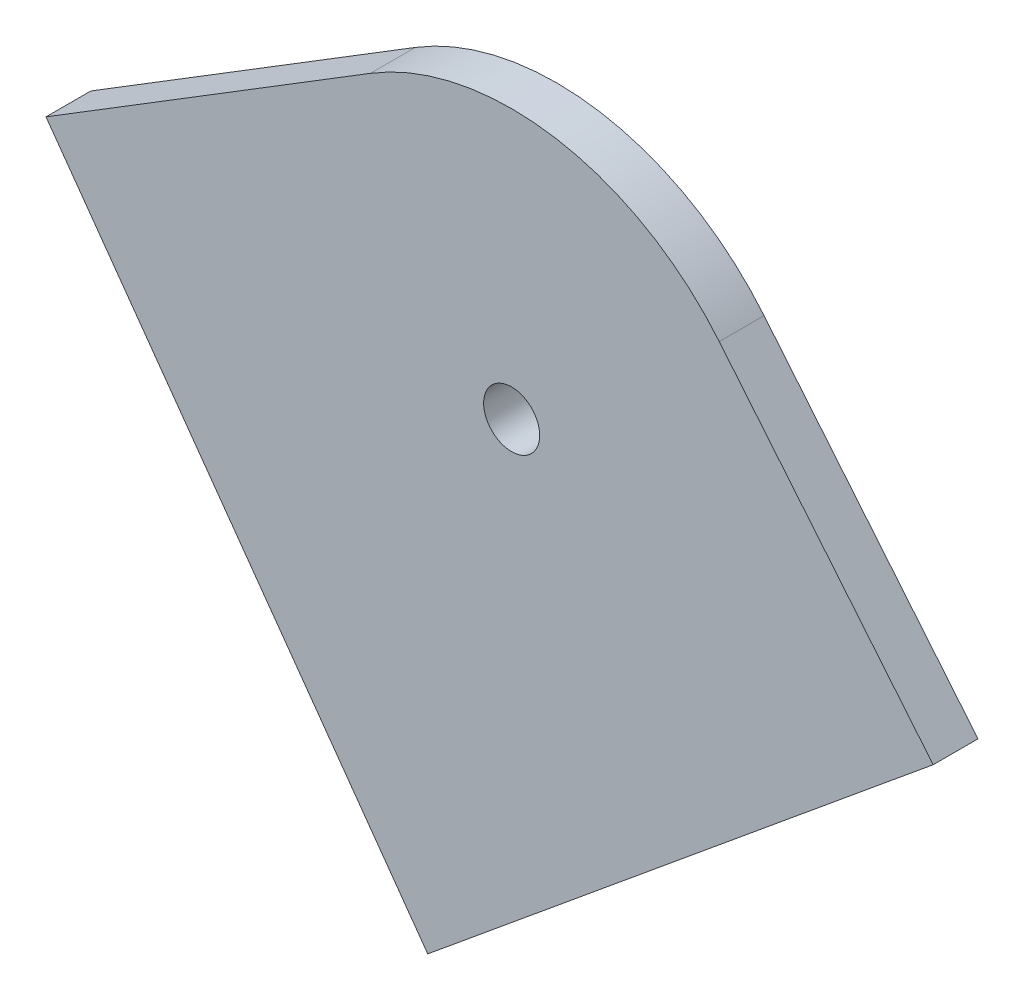
ISO-10303-21;
HEADER;
FILE_DESCRIPTION(('STEP AP214'),'2;1');
FILE_NAME('part.step','',(''),(''),'','','');
FILE_SCHEMA(('AUTOMOTIVE_DESIGN { 1 0 10303 214 1 1 1 1 }'));
ENDSEC;
DATA;
#1=APPLICATION_CONTEXT('core data for automotive mechanical design processes');
#2=APPLICATION_PROTOCOL_DEFINITION('international standard','automotive_design',2000,#1);
#3=PRODUCT_CONTEXT('',#1,'mechanical');
#4=PRODUCT('Part','Part','',(#3));
#5=PRODUCT_RELATED_PRODUCT_CATEGORY('part','',(#4));
#6=PRODUCT_DEFINITION_FORMATION('','',#4);
#7=PRODUCT_DEFINITION_CONTEXT('part definition',#1,'design');
#8=PRODUCT_DEFINITION('design','',#6,#7);
#9=PRODUCT_DEFINITION_SHAPE('','',#8);
#10=(LENGTH_UNIT() NAMED_UNIT(*) SI_UNIT(.MILLI.,.METRE.));
#11=(NAMED_UNIT(*) PLANE_ANGLE_UNIT() SI_UNIT($,.RADIAN.));
#12=(NAMED_UNIT(*) SI_UNIT($,.STERADIAN.) SOLID_ANGLE_UNIT());
#13=UNCERTAINTY_MEASURE_WITH_UNIT(LENGTH_MEASURE(1.E-05),#10,'distance_accuracy_value','');
#14=(GEOMETRIC_REPRESENTATION_CONTEXT(3) GLOBAL_UNCERTAINTY_ASSIGNED_CONTEXT((#13)) GLOBAL_UNIT_ASSIGNED_CONTEXT((#10,
#11,#12)) REPRESENTATION_CONTEXT('',''));
#15=CARTESIAN_POINT('',(0.,0.,0.));
#16=DIRECTION('',(0.,0.,1.));
#17=DIRECTION('',(1.,0.,0.));
#18=AXIS2_PLACEMENT_3D('',#15,#16,#17);
#19=CARTESIAN_POINT('',(-274.861915578243,-226.530149383761,200.66));
#20=DIRECTION('',(0.771691451134559,0.635997094526256,0.));
#21=DIRECTION('',(-0.635997094526256,0.771691451134559,0.));
#22=AXIS2_PLACEMENT_3D('',#19,#20,#21);
#23=PLANE('',#22);
#24=DIRECTION('',(-0.635997094526256,0.771691451134559,0.));
#25=VECTOR('',#24,1.);
#26=CARTESIAN_POINT('',(-274.861915578243,-226.530149383761,203.2));
#27=LINE('',#26,#25);
#28=CARTESIAN_POINT('',(-533.353676422481,87.1126073977048,203.2));
#29=VERTEX_POINT('',#28);
#30=CARTESIAN_POINT('',(-545.469421073206,101.813329541818,203.2));
#31=VERTEX_POINT('',#30);
#32=EDGE_CURVE('E122',#29,#31,#27,.T.);
#33=ORIENTED_EDGE('',*,*,#32,.F.);
#34=DIRECTION('',(0.,0.,1.));
#35=VECTOR('',#34,1.);
#36=CARTESIAN_POINT('',(-533.353676422481,87.1126073977048,200.66));
#37=LINE('',#36,#35);
#38=CARTESIAN_POINT('',(-533.353676422481,87.1126073977048,200.66));
#39=VERTEX_POINT('',#38);
#40=EDGE_CURVE('E11',#39,#29,#37,.T.);
#41=ORIENTED_EDGE('',*,*,#40,.F.);
#42=DIRECTION('',(-0.635997094526256,0.771691451134559,0.));
#43=VECTOR('',#42,1.);
#44=CARTESIAN_POINT('',(-274.861915578243,-226.530149383761,200.66));
#45=LINE('',#44,#43);
#46=CARTESIAN_POINT('',(-545.469421073206,101.813329541818,200.66));
#47=VERTEX_POINT('',#46);
#48=EDGE_CURVE('E130',#39,#47,#45,.T.);
#49=ORIENTED_EDGE('',*,*,#48,.T.);
#50=DIRECTION('',(0.,0.,1.));
#51=VECTOR('',#50,1.);
#52=CARTESIAN_POINT('',(-545.469421073206,101.813329541818,200.66));
#53=LINE('',#52,#51);
#54=EDGE_CURVE('E40',#47,#31,#53,.T.);
#55=ORIENTED_EDGE('',*,*,#54,.T.);
#56=EDGE_LOOP('',(#33,#41,#49,#55));
#57=FACE_BOUND('',#56,.T.);
#58=ADVANCED_FACE('F36',(#57),#23,.T.);
#59=CARTESIAN_POINT('',(-258.491760844237,313.642756781466,200.66));
#60=DIRECTION('',(-0.635997094526254,0.771691451134561,0.));
#61=DIRECTION('',(-0.771691451134561,-0.635997094526254,0.));
#62=AXIS2_PLACEMENT_3D('',#59,#60,#61);
#63=PLANE('',#62);
#64=DIRECTION('',(-0.771691451134561,-0.635997094526254,0.));
#65=VECTOR('',#64,1.);
#66=CARTESIAN_POINT('',(-258.491760844237,313.642756781466,203.2));
#67=LINE('',#66,#65);
#68=CARTESIAN_POINT('',(-561.981999515399,63.5182935284952,203.2));
#69=VERTEX_POINT('',#68);
#70=EDGE_CURVE('E113',#29,#69,#67,.T.);
#71=ORIENTED_EDGE('',*,*,#70,.T.);
#72=DIRECTION('',(0.,0.,1.));
#73=VECTOR('',#72,1.);
#74=CARTESIAN_POINT('',(-561.981999515399,63.5182935284952,200.66));
#75=LINE('',#74,#73);
#76=CARTESIAN_POINT('',(-561.981999515399,63.5182935284952,200.66));
#77=VERTEX_POINT('',#76);
#78=EDGE_CURVE('E46',#77,#69,#75,.T.);
#79=ORIENTED_EDGE('',*,*,#78,.F.);
#80=DIRECTION('',(-0.771691451134561,-0.635997094526254,0.));
#81=VECTOR('',#80,1.);
#82=CARTESIAN_POINT('',(-258.491760844237,313.642756781466,200.66));
#83=LINE('',#82,#81);
#84=EDGE_CURVE('E105',#39,#77,#83,.T.);
#85=ORIENTED_EDGE('',*,*,#84,.F.);
#86=ORIENTED_EDGE('',*,*,#40,.T.);
#87=EDGE_LOOP('',(#71,#79,#85,#86));
#88=FACE_BOUND('',#87,.T.);
#89=ADVANCED_FACE('F152',(#88),#63,.F.);
#90=CARTESIAN_POINT('',(-341.895526842222,-244.384337548954,200.66));
#91=DIRECTION('',(0.81353844698795,0.581511130824196,0.));
#92=DIRECTION('',(-0.581511130824196,0.81353844698795,0.));
#93=AXIS2_PLACEMENT_3D('',#90,#91,#92);
#94=PLANE('',#93);
#95=DIRECTION('',(-0.581511130824196,0.81353844698795,0.));
#96=VECTOR('',#95,1.);
#97=CARTESIAN_POINT('',(-341.895526842222,-244.384337548954,203.2));
#98=LINE('',#97,#96);
#99=CARTESIAN_POINT('',(-583.605490172833,93.7697196413101,203.2));
#100=VERTEX_POINT('',#99);
#101=EDGE_CURVE('E73',#69,#100,#98,.T.);
#102=ORIENTED_EDGE('',*,*,#101,.T.);
#103=DIRECTION('',(0.,0.,1.));
#104=VECTOR('',#103,1.);
#105=CARTESIAN_POINT('',(-583.605490172833,93.7697196413101,200.66));
#106=LINE('',#105,#104);
#107=CARTESIAN_POINT('',(-583.605490172833,93.7697196413101,200.66));
#108=VERTEX_POINT('',#107);
#109=EDGE_CURVE('E96',#108,#100,#106,.T.);
#110=ORIENTED_EDGE('',*,*,#109,.F.);
#111=DIRECTION('',(-0.581511130824196,0.81353844698795,0.));
#112=VECTOR('',#111,1.);
#113=CARTESIAN_POINT('',(-341.895526842222,-244.384337548954,200.66));
#114=LINE('',#113,#112);
#115=EDGE_CURVE('E99',#77,#108,#114,.T.);
#116=ORIENTED_EDGE('',*,*,#115,.F.);
#117=ORIENTED_EDGE('',*,*,#78,.T.);
#118=EDGE_LOOP('',(#102,#110,#116,#117));
#119=FACE_BOUND('',#118,.T.);
#120=ADVANCED_FACE('F109',(#119),#94,.F.);
#121=CARTESIAN_POINT('',(-202.478837377604,328.608610384924,200.66));
#122=DIRECTION('',(0.52458245471224,-0.851359646805086,0.));
#123=DIRECTION('',(0.851359646805086,0.52458245471224,0.));
#124=AXIS2_PLACEMENT_3D('',#121,#122,#123);
#125=PLANE('',#124);
#126=DIRECTION('',(0.851359646805086,0.52458245471224,0.));
#127=VECTOR('',#126,1.);
#128=CARTESIAN_POINT('',(-202.478837377604,328.608610384924,203.2));
#129=LINE('',#128,#127);
#130=CARTESIAN_POINT('',(-565.224635398311,105.095454838547,203.2));
#131=VERTEX_POINT('',#130);
#132=EDGE_CURVE('E117',#100,#131,#129,.T.);
#133=ORIENTED_EDGE('',*,*,#132,.T.);
#134=DIRECTION('',(0.,0.,1.));
#135=VECTOR('',#134,1.);
#136=CARTESIAN_POINT('',(-565.224635398311,105.095454838547,200.66));
#137=LINE('',#136,#135);
#138=CARTESIAN_POINT('',(-565.224635398311,105.095454838547,200.66));
#139=VERTEX_POINT('',#138);
#140=EDGE_CURVE('E97',#139,#131,#137,.T.);
#141=ORIENTED_EDGE('',*,*,#140,.F.);
#142=DIRECTION('',(0.851359646805086,0.52458245471224,0.));
#143=VECTOR('',#142,1.);
#144=CARTESIAN_POINT('',(-202.478837377604,328.608610384924,200.66));
#145=LINE('',#144,#143);
#146=EDGE_CURVE('E91',#108,#139,#145,.T.);
#147=ORIENTED_EDGE('',*,*,#146,.F.);
#148=ORIENTED_EDGE('',*,*,#109,.T.);
#149=EDGE_LOOP('',(#133,#141,#147,#148));
#150=FACE_BOUND('',#149,.T.);
#151=ADVANCED_FACE('F94',(#150),#125,.F.);
#152=CARTESIAN_POINT('',(-557.229998788497,92.1207338212379,200.66));
#153=DIRECTION('',(0.,0.,1.));
#154=DIRECTION('',(1.,0.,0.));
#155=AXIS2_PLACEMENT_3D('',#152,#153,#154);
#156=CYLINDRICAL_SURFACE('',#155,1.58749999999983);
#157=CARTESIAN_POINT('',(-557.229998788497,92.1207338212379,200.66));
#158=DIRECTION('',(0.,0.,1.));
#159=DIRECTION('',(1.,0.,0.));
#160=AXIS2_PLACEMENT_3D('',#157,#158,#159);
#161=CIRCLE('',#160,1.58749999999983);
#162=CARTESIAN_POINT('',(-555.642498788497,92.1207338212379,200.66));
#163=VERTEX_POINT('',#162);
#164=EDGE_CURVE('E115',#163,#163,#161,.T.);
#165=ORIENTED_EDGE('',*,*,#164,.F.);
#166=EDGE_LOOP('',(#165));
#167=FACE_BOUND('',#166,.T.);
#168=CARTESIAN_POINT('',(-557.229998788497,92.1207338212379,203.2));
#169=DIRECTION('',(0.,0.,1.));
#170=DIRECTION('',(1.,0.,0.));
#171=AXIS2_PLACEMENT_3D('',#168,#169,#170);
#172=CIRCLE('',#171,1.58749999999983);
#173=CARTESIAN_POINT('',(-555.642498788497,92.1207338212379,203.2));
#174=VERTEX_POINT('',#173);
#175=EDGE_CURVE('E125',#174,#174,#172,.T.);
#176=ORIENTED_EDGE('',*,*,#175,.T.);
#177=EDGE_LOOP('',(#176));
#178=FACE_BOUND('',#177,.T.);
#179=ADVANCED_FACE('F38',(#167,#178),#156,.F.);
#180=CARTESIAN_POINT('',(-557.229998788497,92.1207338212379,200.66));
#181=DIRECTION('',(0.,0.,1.));
#182=DIRECTION('',(1.,0.,0.));
#183=AXIS2_PLACEMENT_3D('',#180,#181,#182);
#184=CYLINDRICAL_SURFACE('',#183,15.24);
#185=CARTESIAN_POINT('',(-557.229998788497,92.1207338212379,203.2));
#186=DIRECTION('',(0.,0.,1.));
#187=DIRECTION('',(1.,0.,0.));
#188=AXIS2_PLACEMENT_3D('',#185,#186,#187);
#189=CIRCLE('',#188,15.24);
#190=EDGE_CURVE('E119',#31,#131,#189,.T.);
#191=ORIENTED_EDGE('',*,*,#190,.F.);
#192=ORIENTED_EDGE('',*,*,#54,.F.);
#193=CARTESIAN_POINT('',(-557.229998788497,92.1207338212379,200.66));
#194=DIRECTION('',(0.,0.,1.));
#195=DIRECTION('',(1.,0.,0.));
#196=AXIS2_PLACEMENT_3D('',#193,#194,#195);
#197=CIRCLE('',#196,15.24);
#198=EDGE_CURVE('E100',#47,#139,#197,.T.);
#199=ORIENTED_EDGE('',*,*,#198,.T.);
#200=ORIENTED_EDGE('',*,*,#140,.T.);
#201=EDGE_LOOP('',(#191,#192,#199,#200));
#202=FACE_BOUND('',#201,.T.);
#203=ADVANCED_FACE('F138',(#202),#184,.T.);
#204=CARTESIAN_POINT('',(1.11022302462516E-13,0.,200.66));
#205=DIRECTION('',(0.,0.,1.));
#206=DIRECTION('',(1.,0.,0.));
#207=AXIS2_PLACEMENT_3D('',#204,#205,#206);
#208=PLANE('',#207);
#209=ORIENTED_EDGE('',*,*,#164,.T.);
#210=EDGE_LOOP('',(#209));
#211=FACE_BOUND('',#210,.T.);
#212=ORIENTED_EDGE('',*,*,#48,.F.);
#213=ORIENTED_EDGE('',*,*,#84,.T.);
#214=ORIENTED_EDGE('',*,*,#115,.T.);
#215=ORIENTED_EDGE('',*,*,#146,.T.);
#216=ORIENTED_EDGE('',*,*,#198,.F.);
#217=EDGE_LOOP('',(#212,#213,#214,#215,#216));
#218=FACE_BOUND('',#217,.T.);
#219=ADVANCED_FACE('F104',(#211,#218),#208,.F.);
#220=CARTESIAN_POINT('',(1.11022302462516E-13,0.,203.2));
#221=DIRECTION('',(0.,0.,1.));
#222=DIRECTION('',(1.,0.,0.));
#223=AXIS2_PLACEMENT_3D('',#220,#221,#222);
#224=PLANE('',#223);
#225=ORIENTED_EDGE('',*,*,#175,.F.);
#226=EDGE_LOOP('',(#225));
#227=FACE_BOUND('',#226,.T.);
#228=ORIENTED_EDGE('',*,*,#32,.T.);
#229=ORIENTED_EDGE('',*,*,#190,.T.);
#230=ORIENTED_EDGE('',*,*,#132,.F.);
#231=ORIENTED_EDGE('',*,*,#101,.F.);
#232=ORIENTED_EDGE('',*,*,#70,.F.);
#233=EDGE_LOOP('',(#228,#229,#230,#231,#232));
#234=FACE_BOUND('',#233,.T.);
#235=ADVANCED_FACE('F141',(#227,#234),#224,.T.);
#236=CLOSED_SHELL('',(#58,#89,#120,#151,#179,#203,#219,#235));
#237=MANIFOLD_SOLID_BREP('B2',#236);
#238=ADVANCED_BREP_SHAPE_REPRESENTATION('',(#18,#237),#14);
#239=SHAPE_DEFINITION_REPRESENTATION(#9,#238);
ENDSEC;
END-ISO-10303-21;
